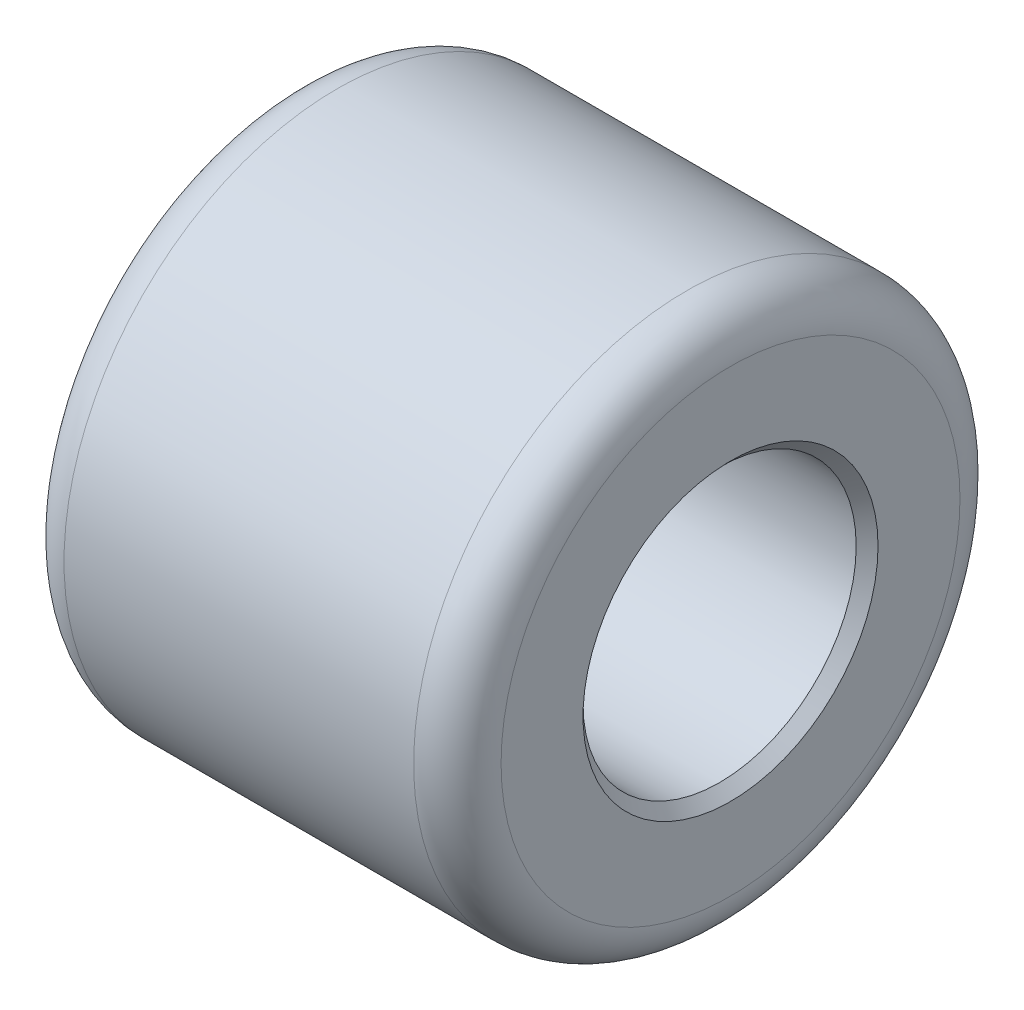
ISO-10303-21;
HEADER;
FILE_DESCRIPTION(('STEP AP214'),'2;1');
FILE_NAME('part.step','',(''),(''),'','','');
FILE_SCHEMA(('AUTOMOTIVE_DESIGN { 1 0 10303 214 1 1 1 1 }'));
ENDSEC;
DATA;
#1=APPLICATION_CONTEXT('core data for automotive mechanical design processes');
#2=APPLICATION_PROTOCOL_DEFINITION('international standard','automotive_design',2000,#1);
#3=PRODUCT_CONTEXT('',#1,'mechanical');
#4=PRODUCT('Part','Part','',(#3));
#5=PRODUCT_RELATED_PRODUCT_CATEGORY('part','',(#4));
#6=PRODUCT_DEFINITION_FORMATION('','',#4);
#7=PRODUCT_DEFINITION_CONTEXT('part definition',#1,'design');
#8=PRODUCT_DEFINITION('design','',#6,#7);
#9=PRODUCT_DEFINITION_SHAPE('','',#8);
#10=(LENGTH_UNIT() NAMED_UNIT(*) SI_UNIT(.MILLI.,.METRE.));
#11=(NAMED_UNIT(*) PLANE_ANGLE_UNIT() SI_UNIT($,.RADIAN.));
#12=(NAMED_UNIT(*) SI_UNIT($,.STERADIAN.) SOLID_ANGLE_UNIT());
#13=UNCERTAINTY_MEASURE_WITH_UNIT(LENGTH_MEASURE(1.E-05),#10,'distance_accuracy_value','');
#14=(GEOMETRIC_REPRESENTATION_CONTEXT(3) GLOBAL_UNCERTAINTY_ASSIGNED_CONTEXT((#13)) GLOBAL_UNIT_ASSIGNED_CONTEXT((#10,
#11,#12)) REPRESENTATION_CONTEXT('',''));
#15=CARTESIAN_POINT('',(0.,0.,0.));
#16=DIRECTION('',(0.,0.,1.));
#17=DIRECTION('',(1.,0.,0.));
#18=AXIS2_PLACEMENT_3D('',#15,#16,#17);
#19=CARTESIAN_POINT('',(500.,0.,0.));
#20=DIRECTION('',(1.,0.,0.));
#21=DIRECTION('',(0.,0.,-1.));
#22=AXIS2_PLACEMENT_3D('',#19,#20,#21);
#23=PLANE('',#22);
#24=CARTESIAN_POINT('',(500.,0.,0.));
#25=DIRECTION('',(1.,0.,0.));
#26=DIRECTION('',(0.,0.,-1.));
#27=AXIS2_PLACEMENT_3D('',#24,#25,#26);
#28=CIRCLE('',#27,262.5);
#29=CARTESIAN_POINT('',(500.,0.,-262.5));
#30=VERTEX_POINT('',#29);
#31=EDGE_CURVE('E10',#30,#30,#28,.T.);
#32=ORIENTED_EDGE('',*,*,#31,.T.);
#33=EDGE_LOOP('',(#32));
#34=FACE_BOUND('',#33,.T.);
#35=CARTESIAN_POINT('',(500.,0.,0.));
#36=DIRECTION('',(1.,0.,0.));
#37=DIRECTION('',(0.,0.,-1.));
#38=AXIS2_PLACEMENT_3D('',#35,#36,#37);
#39=CIRCLE('',#38,168.75);
#40=CARTESIAN_POINT('',(500.,0.,-168.75));
#41=VERTEX_POINT('',#40);
#42=EDGE_CURVE('E54',#41,#41,#39,.F.);
#43=ORIENTED_EDGE('',*,*,#42,.T.);
#44=EDGE_LOOP('',(#43));
#45=FACE_BOUND('',#44,.T.);
#46=ADVANCED_FACE('F34',(#34,#45),#23,.T.);
#47=CARTESIAN_POINT('',(0.,0.,0.));
#48=DIRECTION('',(1.,0.,0.));
#49=DIRECTION('',(0.,0.,-1.));
#50=AXIS2_PLACEMENT_3D('',#47,#48,#49);
#51=PLANE('',#50);
#52=CARTESIAN_POINT('',(0.,0.,0.));
#53=DIRECTION('',(1.,0.,0.));
#54=DIRECTION('',(0.,0.,-1.));
#55=AXIS2_PLACEMENT_3D('',#52,#53,#54);
#56=CIRCLE('',#55,262.5);
#57=CARTESIAN_POINT('',(0.,0.,-262.5));
#58=VERTEX_POINT('',#57);
#59=EDGE_CURVE('E41',#58,#58,#56,.F.);
#60=ORIENTED_EDGE('',*,*,#59,.T.);
#61=EDGE_LOOP('',(#60));
#62=FACE_BOUND('',#61,.T.);
#63=CARTESIAN_POINT('',(0.,0.,0.));
#64=DIRECTION('',(1.,0.,0.));
#65=DIRECTION('',(0.,0.,-1.));
#66=AXIS2_PLACEMENT_3D('',#63,#64,#65);
#67=CIRCLE('',#66,168.75);
#68=CARTESIAN_POINT('',(0.,0.,-168.75));
#69=VERTEX_POINT('',#68);
#70=EDGE_CURVE('E63',#69,#69,#67,.T.);
#71=ORIENTED_EDGE('',*,*,#70,.T.);
#72=EDGE_LOOP('',(#71));
#73=FACE_BOUND('',#72,.T.);
#74=ADVANCED_FACE('F67',(#62,#73),#51,.F.);
#75=CARTESIAN_POINT('',(500.,0.,0.));
#76=DIRECTION('',(-1.,0.,0.));
#77=DIRECTION('',(0.,0.,1.));
#78=AXIS2_PLACEMENT_3D('',#75,#76,#77);
#79=CYLINDRICAL_SURFACE('',#78,312.5);
#80=CARTESIAN_POINT('',(50.,0.,0.));
#81=DIRECTION('',(1.,0.,0.));
#82=DIRECTION('',(0.,0.,-1.));
#83=AXIS2_PLACEMENT_3D('',#80,#81,#82);
#84=CIRCLE('',#83,312.5);
#85=CARTESIAN_POINT('',(50.,0.,-312.5));
#86=VERTEX_POINT('',#85);
#87=EDGE_CURVE('E45',#86,#86,#84,.T.);
#88=ORIENTED_EDGE('',*,*,#87,.T.);
#89=EDGE_LOOP('',(#88));
#90=FACE_BOUND('',#89,.T.);
#91=CARTESIAN_POINT('',(450.,0.,0.));
#92=DIRECTION('',(1.,0.,0.));
#93=DIRECTION('',(0.,0.,-1.));
#94=AXIS2_PLACEMENT_3D('',#91,#92,#93);
#95=CIRCLE('',#94,312.5);
#96=CARTESIAN_POINT('',(450.,0.,-312.5));
#97=VERTEX_POINT('',#96);
#98=EDGE_CURVE('E49',#97,#97,#95,.F.);
#99=ORIENTED_EDGE('',*,*,#98,.T.);
#100=EDGE_LOOP('',(#99));
#101=FACE_BOUND('',#100,.T.);
#102=ADVANCED_FACE('F82',(#90,#101),#79,.T.);
#103=CARTESIAN_POINT('',(500.,0.,0.));
#104=DIRECTION('',(-1.,0.,0.));
#105=DIRECTION('',(0.,0.,1.));
#106=AXIS2_PLACEMENT_3D('',#103,#104,#105);
#107=CYLINDRICAL_SURFACE('',#106,156.25);
#108=CARTESIAN_POINT('',(12.5,0.,0.));
#109=DIRECTION('',(1.,0.,0.));
#110=DIRECTION('',(0.,0.,-1.));
#111=AXIS2_PLACEMENT_3D('',#108,#109,#110);
#112=CIRCLE('',#111,156.25);
#113=CARTESIAN_POINT('',(12.5,0.,-156.25));
#114=VERTEX_POINT('',#113);
#115=EDGE_CURVE('E57',#114,#114,#112,.F.);
#116=ORIENTED_EDGE('',*,*,#115,.T.);
#117=EDGE_LOOP('',(#116));
#118=FACE_BOUND('',#117,.T.);
#119=CARTESIAN_POINT('',(487.5,0.,0.));
#120=DIRECTION('',(1.,0.,0.));
#121=DIRECTION('',(0.,0.,-1.));
#122=AXIS2_PLACEMENT_3D('',#119,#120,#121);
#123=CIRCLE('',#122,156.25);
#124=CARTESIAN_POINT('',(487.5,0.,-156.25));
#125=VERTEX_POINT('',#124);
#126=EDGE_CURVE('E60',#125,#125,#123,.T.);
#127=ORIENTED_EDGE('',*,*,#126,.T.);
#128=EDGE_LOOP('',(#127));
#129=FACE_BOUND('',#128,.T.);
#130=ADVANCED_FACE('F72',(#118,#129),#107,.F.);
#131=CARTESIAN_POINT('',(0.,0.,0.));
#132=DIRECTION('',(-1.,0.,0.));
#133=DIRECTION('',(0.,0.,1.));
#134=AXIS2_PLACEMENT_3D('',#131,#132,#133);
#135=CONICAL_SURFACE('',#134,168.75,0.785398163397442);
#136=ORIENTED_EDGE('',*,*,#115,.F.);
#137=EDGE_LOOP('',(#136));
#138=FACE_BOUND('',#137,.T.);
#139=ORIENTED_EDGE('',*,*,#70,.F.);
#140=EDGE_LOOP('',(#139));
#141=FACE_BOUND('',#140,.T.);
#142=ADVANCED_FACE('F69',(#138,#141),#135,.F.);
#143=CARTESIAN_POINT('',(487.5,0.,0.));
#144=DIRECTION('',(1.,0.,0.));
#145=DIRECTION('',(0.,0.,-1.));
#146=AXIS2_PLACEMENT_3D('',#143,#144,#145);
#147=CONICAL_SURFACE('',#146,156.25,0.785398163397451);
#148=ORIENTED_EDGE('',*,*,#42,.F.);
#149=EDGE_LOOP('',(#148));
#150=FACE_BOUND('',#149,.T.);
#151=ORIENTED_EDGE('',*,*,#126,.F.);
#152=EDGE_LOOP('',(#151));
#153=FACE_BOUND('',#152,.T.);
#154=ADVANCED_FACE('F71',(#150,#153),#147,.F.);
#155=CARTESIAN_POINT('',(50.,0.,0.));
#156=DIRECTION('',(1.,0.,0.));
#157=DIRECTION('',(0.,0.,-1.));
#158=AXIS2_PLACEMENT_3D('',#155,#156,#157);
#159=TOROIDAL_SURFACE('',#158,262.5,50.);
#160=ORIENTED_EDGE('',*,*,#59,.F.);
#161=EDGE_LOOP('',(#160));
#162=FACE_BOUND('',#161,.T.);
#163=ORIENTED_EDGE('',*,*,#87,.F.);
#164=EDGE_LOOP('',(#163));
#165=FACE_BOUND('',#164,.T.);
#166=ADVANCED_FACE('F79',(#162,#165),#159,.T.);
#167=CARTESIAN_POINT('',(450.,0.,0.));
#168=DIRECTION('',(1.,0.,0.));
#169=DIRECTION('',(0.,0.,-1.));
#170=AXIS2_PLACEMENT_3D('',#167,#168,#169);
#171=TOROIDAL_SURFACE('',#170,262.5,50.);
#172=ORIENTED_EDGE('',*,*,#98,.F.);
#173=EDGE_LOOP('',(#172));
#174=FACE_BOUND('',#173,.T.);
#175=ORIENTED_EDGE('',*,*,#31,.F.);
#176=EDGE_LOOP('',(#175));
#177=FACE_BOUND('',#176,.T.);
#178=ADVANCED_FACE('F36',(#174,#177),#171,.T.);
#179=CLOSED_SHELL('',(#46,#74,#102,#130,#142,#154,#166,#178));
#180=MANIFOLD_SOLID_BREP('B2',#179);
#181=ADVANCED_BREP_SHAPE_REPRESENTATION('',(#18,#180),#14);
#182=SHAPE_DEFINITION_REPRESENTATION(#9,#181);
ENDSEC;
END-ISO-10303-21;
